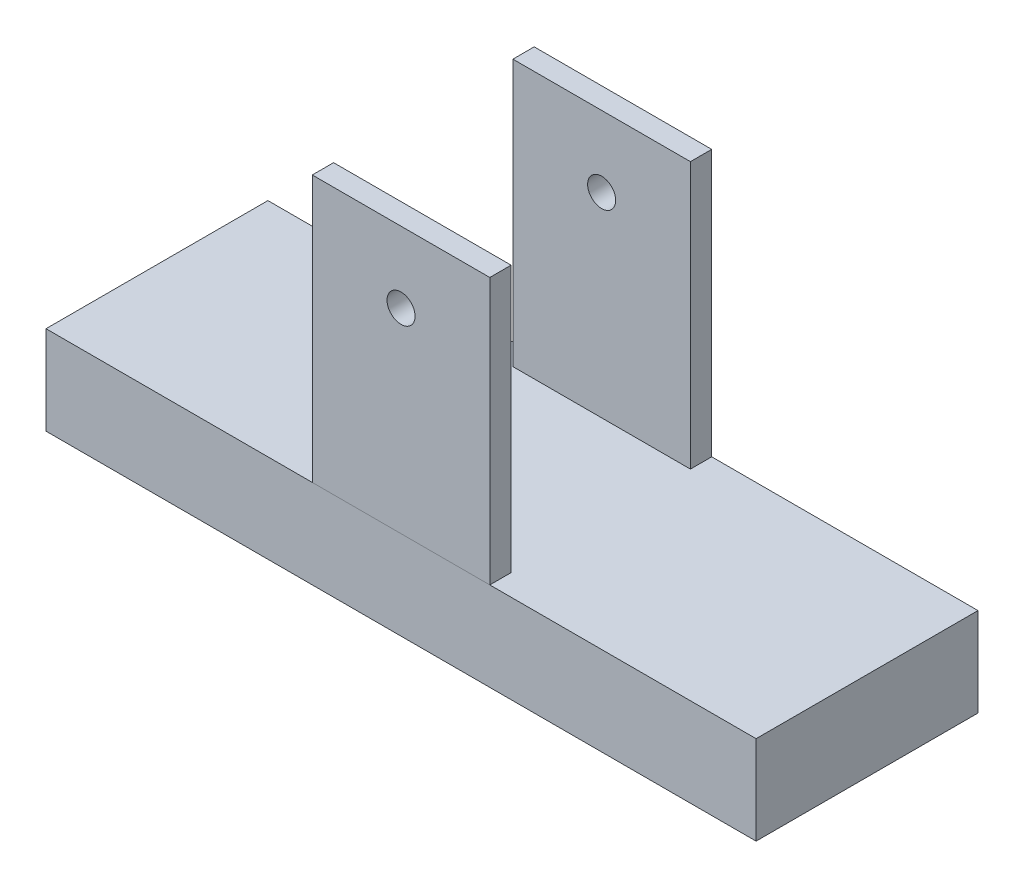
ISO-10303-21;
HEADER;
FILE_DESCRIPTION(('STEP AP214'),'2;1');
FILE_NAME('part.step','',(''),(''),'','','');
FILE_SCHEMA(('AUTOMOTIVE_DESIGN { 1 0 10303 214 1 1 1 1 }'));
ENDSEC;
DATA;
#1=APPLICATION_CONTEXT('core data for automotive mechanical design processes');
#2=APPLICATION_PROTOCOL_DEFINITION('international standard','automotive_design',2000,#1);
#3=PRODUCT_CONTEXT('',#1,'mechanical');
#4=PRODUCT('Part','Part','',(#3));
#5=PRODUCT_RELATED_PRODUCT_CATEGORY('part','',(#4));
#6=PRODUCT_DEFINITION_FORMATION('','',#4);
#7=PRODUCT_DEFINITION_CONTEXT('part definition',#1,'design');
#8=PRODUCT_DEFINITION('design','',#6,#7);
#9=PRODUCT_DEFINITION_SHAPE('','',#8);
#10=(LENGTH_UNIT() NAMED_UNIT(*) SI_UNIT(.MILLI.,.METRE.));
#11=(NAMED_UNIT(*) PLANE_ANGLE_UNIT() SI_UNIT($,.RADIAN.));
#12=(NAMED_UNIT(*) SI_UNIT($,.STERADIAN.) SOLID_ANGLE_UNIT());
#13=UNCERTAINTY_MEASURE_WITH_UNIT(LENGTH_MEASURE(1.E-05),#10,'distance_accuracy_value','');
#14=(GEOMETRIC_REPRESENTATION_CONTEXT(3) GLOBAL_UNCERTAINTY_ASSIGNED_CONTEXT((#13)) GLOBAL_UNIT_ASSIGNED_CONTEXT((#10,
#11,#12)) REPRESENTATION_CONTEXT('',''));
#15=CARTESIAN_POINT('',(0.,0.,0.));
#16=DIRECTION('',(0.,0.,1.));
#17=DIRECTION('',(1.,0.,0.));
#18=AXIS2_PLACEMENT_3D('',#15,#16,#17);
#19=CARTESIAN_POINT('',(-250.,200.,-113.));
#20=DIRECTION('',(0.,0.,-1.));
#21=DIRECTION('',(-1.,0.,0.));
#22=AXIS2_PLACEMENT_3D('',#19,#20,#21);
#23=PLANE('',#22);
#24=CARTESIAN_POINT('',(-200.,160.,-113.));
#25=DIRECTION('',(0.,0.,-1.));
#26=DIRECTION('',(-1.,0.,0.));
#27=AXIS2_PLACEMENT_3D('',#24,#25,#26);
#28=CIRCLE('',#27,7.89999999999999);
#29=CARTESIAN_POINT('',(-207.9,160.,-113.));
#30=VERTEX_POINT('',#29);
#31=EDGE_CURVE('E109',#30,#30,#28,.T.);
#32=ORIENTED_EDGE('',*,*,#31,.T.);
#33=EDGE_LOOP('',(#32));
#34=FACE_BOUND('',#33,.T.);
#35=DIRECTION('',(1.,0.,0.));
#36=VECTOR('',#35,1.);
#37=CARTESIAN_POINT('',(-250.,50.,-113.));
#38=LINE('',#37,#36);
#39=CARTESIAN_POINT('',(-250.,50.,-113.));
#40=VERTEX_POINT('',#39);
#41=CARTESIAN_POINT('',(-150.,50.,-113.));
#42=VERTEX_POINT('',#41);
#43=EDGE_CURVE('E106',#40,#42,#38,.T.);
#44=ORIENTED_EDGE('',*,*,#43,.T.);
#45=DIRECTION('',(0.,-1.,0.));
#46=VECTOR('',#45,1.);
#47=CARTESIAN_POINT('',(-150.,200.,-113.));
#48=LINE('',#47,#46);
#49=CARTESIAN_POINT('',(-150.,200.,-113.));
#50=VERTEX_POINT('',#49);
#51=EDGE_CURVE('E12',#50,#42,#48,.T.);
#52=ORIENTED_EDGE('',*,*,#51,.F.);
#53=DIRECTION('',(1.,0.,0.));
#54=VECTOR('',#53,1.);
#55=CARTESIAN_POINT('',(-250.,200.,-113.));
#56=LINE('',#55,#54);
#57=CARTESIAN_POINT('',(-250.,200.,-113.));
#58=VERTEX_POINT('',#57);
#59=EDGE_CURVE('E94',#58,#50,#56,.T.);
#60=ORIENTED_EDGE('',*,*,#59,.F.);
#61=DIRECTION('',(0.,-1.,0.));
#62=VECTOR('',#61,1.);
#63=CARTESIAN_POINT('',(-250.,200.,-113.));
#64=LINE('',#63,#62);
#65=EDGE_CURVE('E102',#58,#40,#64,.T.);
#66=ORIENTED_EDGE('',*,*,#65,.T.);
#67=EDGE_LOOP('',(#44,#52,#60,#66));
#68=FACE_BOUND('',#67,.T.);
#69=ADVANCED_FACE('F43',(#34,#68),#23,.F.);
#70=CARTESIAN_POINT('',(-150.,200.,-113.));
#71=DIRECTION('',(-1.,0.,0.));
#72=DIRECTION('',(0.,-1.,0.));
#73=AXIS2_PLACEMENT_3D('',#70,#71,#72);
#74=PLANE('',#73);
#75=DIRECTION('',(0.,0.,-1.));
#76=VECTOR('',#75,1.);
#77=CARTESIAN_POINT('',(-150.,50.,-113.));
#78=LINE('',#77,#76);
#79=CARTESIAN_POINT('',(-150.,50.,-125.));
#80=VERTEX_POINT('',#79);
#81=EDGE_CURVE('E98',#42,#80,#78,.T.);
#82=ORIENTED_EDGE('',*,*,#81,.T.);
#83=DIRECTION('',(0.,-1.,0.));
#84=VECTOR('',#83,1.);
#85=CARTESIAN_POINT('',(-150.,200.,-125.));
#86=LINE('',#85,#84);
#87=CARTESIAN_POINT('',(-150.,200.,-125.));
#88=VERTEX_POINT('',#87);
#89=EDGE_CURVE('E51',#88,#80,#86,.T.);
#90=ORIENTED_EDGE('',*,*,#89,.F.);
#91=DIRECTION('',(0.,0.,-1.));
#92=VECTOR('',#91,1.);
#93=CARTESIAN_POINT('',(-150.,200.,-113.));
#94=LINE('',#93,#92);
#95=EDGE_CURVE('E89',#50,#88,#94,.T.);
#96=ORIENTED_EDGE('',*,*,#95,.F.);
#97=ORIENTED_EDGE('',*,*,#51,.T.);
#98=EDGE_LOOP('',(#82,#90,#96,#97));
#99=FACE_BOUND('',#98,.T.);
#100=ADVANCED_FACE('F97',(#99),#74,.F.);
#101=CARTESIAN_POINT('',(-150.,200.,-125.));
#102=DIRECTION('',(0.,0.,1.));
#103=DIRECTION('',(1.,0.,0.));
#104=AXIS2_PLACEMENT_3D('',#101,#102,#103);
#105=PLANE('',#104);
#106=CARTESIAN_POINT('',(-200.,160.,-125.));
#107=DIRECTION('',(0.,0.,1.));
#108=DIRECTION('',(1.,0.,0.));
#109=AXIS2_PLACEMENT_3D('',#106,#107,#108);
#110=CIRCLE('',#109,7.89999999999999);
#111=CARTESIAN_POINT('',(-192.1,160.,-125.));
#112=VERTEX_POINT('',#111);
#113=EDGE_CURVE('E122',#112,#112,#110,.T.);
#114=ORIENTED_EDGE('',*,*,#113,.T.);
#115=EDGE_LOOP('',(#114));
#116=FACE_BOUND('',#115,.T.);
#117=DIRECTION('',(-1.,0.,0.));
#118=VECTOR('',#117,1.);
#119=CARTESIAN_POINT('',(-150.,50.,-125.));
#120=LINE('',#119,#118);
#121=CARTESIAN_POINT('',(-250.,50.,-125.));
#122=VERTEX_POINT('',#121);
#123=EDGE_CURVE('E76',#80,#122,#120,.T.);
#124=ORIENTED_EDGE('',*,*,#123,.T.);
#125=DIRECTION('',(0.,-1.,0.));
#126=VECTOR('',#125,1.);
#127=CARTESIAN_POINT('',(-250.,200.,-125.));
#128=LINE('',#127,#126);
#129=CARTESIAN_POINT('',(-250.,200.,-125.));
#130=VERTEX_POINT('',#129);
#131=EDGE_CURVE('E99',#130,#122,#128,.T.);
#132=ORIENTED_EDGE('',*,*,#131,.F.);
#133=DIRECTION('',(-1.,0.,0.));
#134=VECTOR('',#133,1.);
#135=CARTESIAN_POINT('',(-150.,200.,-125.));
#136=LINE('',#135,#134);
#137=EDGE_CURVE('E92',#88,#130,#136,.T.);
#138=ORIENTED_EDGE('',*,*,#137,.F.);
#139=ORIENTED_EDGE('',*,*,#89,.T.);
#140=EDGE_LOOP('',(#124,#132,#138,#139));
#141=FACE_BOUND('',#140,.T.);
#142=ADVANCED_FACE('F100',(#116,#141),#105,.F.);
#143=CARTESIAN_POINT('',(-250.,200.,-125.));
#144=DIRECTION('',(1.,0.,0.));
#145=DIRECTION('',(0.,1.,0.));
#146=AXIS2_PLACEMENT_3D('',#143,#144,#145);
#147=PLANE('',#146);
#148=DIRECTION('',(0.,0.,1.));
#149=VECTOR('',#148,1.);
#150=CARTESIAN_POINT('',(-250.,50.,-125.));
#151=LINE('',#150,#149);
#152=EDGE_CURVE('E82',#122,#40,#151,.T.);
#153=ORIENTED_EDGE('',*,*,#152,.T.);
#154=ORIENTED_EDGE('',*,*,#65,.F.);
#155=DIRECTION('',(0.,0.,1.));
#156=VECTOR('',#155,1.);
#157=CARTESIAN_POINT('',(-250.,200.,-125.));
#158=LINE('',#157,#156);
#159=EDGE_CURVE('E59',#130,#58,#158,.T.);
#160=ORIENTED_EDGE('',*,*,#159,.F.);
#161=ORIENTED_EDGE('',*,*,#131,.T.);
#162=EDGE_LOOP('',(#153,#154,#160,#161));
#163=FACE_BOUND('',#162,.T.);
#164=ADVANCED_FACE('F114',(#163),#147,.F.);
#165=CARTESIAN_POINT('',(0.,200.,0.));
#166=DIRECTION('',(0.,1.,0.));
#167=DIRECTION('',(-1.,0.,0.));
#168=AXIS2_PLACEMENT_3D('',#165,#166,#167);
#169=PLANE('',#168);
#170=ORIENTED_EDGE('',*,*,#59,.T.);
#171=ORIENTED_EDGE('',*,*,#95,.T.);
#172=ORIENTED_EDGE('',*,*,#137,.T.);
#173=ORIENTED_EDGE('',*,*,#159,.T.);
#174=EDGE_LOOP('',(#170,#171,#172,#173));
#175=FACE_BOUND('',#174,.T.);
#176=ADVANCED_FACE('F90',(#175),#169,.T.);
#177=CARTESIAN_POINT('',(0.,50.,0.));
#178=DIRECTION('',(0.,1.,0.));
#179=DIRECTION('',(-1.,0.,0.));
#180=AXIS2_PLACEMENT_3D('',#177,#178,#179);
#181=PLANE('',#180);
#182=ORIENTED_EDGE('',*,*,#43,.F.);
#183=ORIENTED_EDGE('',*,*,#152,.F.);
#184=ORIENTED_EDGE('',*,*,#123,.F.);
#185=ORIENTED_EDGE('',*,*,#81,.F.);
#186=EDGE_LOOP('',(#182,#183,#184,#185));
#187=FACE_BOUND('',#186,.T.);
#188=ADVANCED_FACE('F117',(#187),#181,.F.);
#189=CARTESIAN_POINT('',(-200.,160.,-125.));
#190=DIRECTION('',(0.,0.,1.));
#191=DIRECTION('',(1.,0.,0.));
#192=AXIS2_PLACEMENT_3D('',#189,#190,#191);
#193=CYLINDRICAL_SURFACE('',#192,7.89999999999999);
#194=ORIENTED_EDGE('',*,*,#113,.F.);
#195=EDGE_LOOP('',(#194));
#196=FACE_BOUND('',#195,.T.);
#197=ORIENTED_EDGE('',*,*,#31,.F.);
#198=EDGE_LOOP('',(#197));
#199=FACE_BOUND('',#198,.T.);
#200=ADVANCED_FACE('F127',(#196,#199),#193,.F.);
#201=CLOSED_SHELL('',(#69,#100,#142,#164,#176,#188,#200));
#202=MANIFOLD_SOLID_BREP('B2',#201);
#203=CARTESIAN_POINT('',(-150.,200.,0.));
#204=DIRECTION('',(0.,0.,-1.));
#205=DIRECTION('',(-1.,0.,0.));
#206=AXIS2_PLACEMENT_3D('',#203,#204,#205);
#207=PLANE('',#206);
#208=CARTESIAN_POINT('',(-200.,160.,0.));
#209=DIRECTION('',(0.,0.,-1.));
#210=DIRECTION('',(-1.,0.,0.));
#211=AXIS2_PLACEMENT_3D('',#208,#209,#210);
#212=CIRCLE('',#211,7.89999999999999);
#213=CARTESIAN_POINT('',(-207.9,160.,0.));
#214=VERTEX_POINT('',#213);
#215=EDGE_CURVE('E264',#214,#214,#212,.T.);
#216=ORIENTED_EDGE('',*,*,#215,.T.);
#217=EDGE_LOOP('',(#216));
#218=FACE_BOUND('',#217,.T.);
#219=DIRECTION('',(1.,0.,0.));
#220=VECTOR('',#219,1.);
#221=CARTESIAN_POINT('',(-150.,50.,0.));
#222=LINE('',#221,#220);
#223=CARTESIAN_POINT('',(-250.,50.,0.));
#224=VERTEX_POINT('',#223);
#225=CARTESIAN_POINT('',(-150.,50.,0.));
#226=VERTEX_POINT('',#225);
#227=EDGE_CURVE('E261',#224,#226,#222,.T.);
#228=ORIENTED_EDGE('',*,*,#227,.T.);
#229=DIRECTION('',(0.,-1.,0.));
#230=VECTOR('',#229,1.);
#231=CARTESIAN_POINT('',(-150.,200.,0.));
#232=LINE('',#231,#230);
#233=CARTESIAN_POINT('',(-150.,200.,0.));
#234=VERTEX_POINT('',#233);
#235=EDGE_CURVE('E41',#234,#226,#232,.T.);
#236=ORIENTED_EDGE('',*,*,#235,.F.);
#237=DIRECTION('',(1.,0.,0.));
#238=VECTOR('',#237,1.);
#239=CARTESIAN_POINT('',(-150.,200.,0.));
#240=LINE('',#239,#238);
#241=CARTESIAN_POINT('',(-250.,200.,0.));
#242=VERTEX_POINT('',#241);
#243=EDGE_CURVE('E248',#242,#234,#240,.T.);
#244=ORIENTED_EDGE('',*,*,#243,.F.);
#245=DIRECTION('',(0.,-1.,0.));
#246=VECTOR('',#245,1.);
#247=CARTESIAN_POINT('',(-250.,200.,0.));
#248=LINE('',#247,#246);
#249=EDGE_CURVE('E257',#242,#224,#248,.T.);
#250=ORIENTED_EDGE('',*,*,#249,.T.);
#251=EDGE_LOOP('',(#228,#236,#244,#250));
#252=FACE_BOUND('',#251,.T.);
#253=ADVANCED_FACE('F196',(#218,#252),#207,.F.);
#254=CARTESIAN_POINT('',(-150.,200.,-12.));
#255=DIRECTION('',(-1.,0.,0.));
#256=DIRECTION('',(0.,-1.,0.));
#257=AXIS2_PLACEMENT_3D('',#254,#255,#256);
#258=PLANE('',#257);
#259=DIRECTION('',(0.,0.,-1.));
#260=VECTOR('',#259,1.);
#261=CARTESIAN_POINT('',(-150.,50.,-12.));
#262=LINE('',#261,#260);
#263=CARTESIAN_POINT('',(-150.,50.,-12.));
#264=VERTEX_POINT('',#263);
#265=EDGE_CURVE('E252',#226,#264,#262,.T.);
#266=ORIENTED_EDGE('',*,*,#265,.T.);
#267=DIRECTION('',(0.,-1.,0.));
#268=VECTOR('',#267,1.);
#269=CARTESIAN_POINT('',(-150.,200.,-12.));
#270=LINE('',#269,#268);
#271=CARTESIAN_POINT('',(-150.,200.,-12.));
#272=VERTEX_POINT('',#271);
#273=EDGE_CURVE('E205',#272,#264,#270,.T.);
#274=ORIENTED_EDGE('',*,*,#273,.F.);
#275=DIRECTION('',(0.,0.,-1.));
#276=VECTOR('',#275,1.);
#277=CARTESIAN_POINT('',(-150.,200.,-12.));
#278=LINE('',#277,#276);
#279=EDGE_CURVE('E243',#234,#272,#278,.T.);
#280=ORIENTED_EDGE('',*,*,#279,.F.);
#281=ORIENTED_EDGE('',*,*,#235,.T.);
#282=EDGE_LOOP('',(#266,#274,#280,#281));
#283=FACE_BOUND('',#282,.T.);
#284=ADVANCED_FACE('F251',(#283),#258,.F.);
#285=CARTESIAN_POINT('',(-250.,200.,-12.));
#286=DIRECTION('',(0.,0.,1.));
#287=DIRECTION('',(1.,0.,0.));
#288=AXIS2_PLACEMENT_3D('',#285,#286,#287);
#289=PLANE('',#288);
#290=CARTESIAN_POINT('',(-200.,160.,-12.));
#291=DIRECTION('',(0.,0.,1.));
#292=DIRECTION('',(1.,0.,0.));
#293=AXIS2_PLACEMENT_3D('',#290,#291,#292);
#294=CIRCLE('',#293,7.89999999999999);
#295=CARTESIAN_POINT('',(-192.1,160.,-12.));
#296=VERTEX_POINT('',#295);
#297=EDGE_CURVE('E199',#296,#296,#294,.T.);
#298=ORIENTED_EDGE('',*,*,#297,.T.);
#299=EDGE_LOOP('',(#298));
#300=FACE_BOUND('',#299,.T.);
#301=DIRECTION('',(-1.,0.,0.));
#302=VECTOR('',#301,1.);
#303=CARTESIAN_POINT('',(-250.,50.,-12.));
#304=LINE('',#303,#302);
#305=CARTESIAN_POINT('',(-250.,50.,-12.));
#306=VERTEX_POINT('',#305);
#307=EDGE_CURVE('E230',#264,#306,#304,.T.);
#308=ORIENTED_EDGE('',*,*,#307,.T.);
#309=DIRECTION('',(0.,-1.,0.));
#310=VECTOR('',#309,1.);
#311=CARTESIAN_POINT('',(-250.,200.,-12.));
#312=LINE('',#311,#310);
#313=CARTESIAN_POINT('',(-250.,200.,-12.));
#314=VERTEX_POINT('',#313);
#315=EDGE_CURVE('E253',#314,#306,#312,.T.);
#316=ORIENTED_EDGE('',*,*,#315,.F.);
#317=DIRECTION('',(-1.,0.,0.));
#318=VECTOR('',#317,1.);
#319=CARTESIAN_POINT('',(-250.,200.,-12.));
#320=LINE('',#319,#318);
#321=EDGE_CURVE('E246',#272,#314,#320,.T.);
#322=ORIENTED_EDGE('',*,*,#321,.F.);
#323=ORIENTED_EDGE('',*,*,#273,.T.);
#324=EDGE_LOOP('',(#308,#316,#322,#323));
#325=FACE_BOUND('',#324,.T.);
#326=ADVANCED_FACE('F255',(#300,#325),#289,.F.);
#327=CARTESIAN_POINT('',(-250.,200.,0.));
#328=DIRECTION('',(1.,0.,0.));
#329=DIRECTION('',(0.,1.,0.));
#330=AXIS2_PLACEMENT_3D('',#327,#328,#329);
#331=PLANE('',#330);
#332=DIRECTION('',(0.,0.,1.));
#333=VECTOR('',#332,1.);
#334=CARTESIAN_POINT('',(-250.,50.,0.));
#335=LINE('',#334,#333);
#336=EDGE_CURVE('E236',#306,#224,#335,.T.);
#337=ORIENTED_EDGE('',*,*,#336,.T.);
#338=ORIENTED_EDGE('',*,*,#249,.F.);
#339=DIRECTION('',(0.,0.,1.));
#340=VECTOR('',#339,1.);
#341=CARTESIAN_POINT('',(-250.,200.,0.));
#342=LINE('',#341,#340);
#343=EDGE_CURVE('E213',#314,#242,#342,.T.);
#344=ORIENTED_EDGE('',*,*,#343,.F.);
#345=ORIENTED_EDGE('',*,*,#315,.T.);
#346=EDGE_LOOP('',(#337,#338,#344,#345));
#347=FACE_BOUND('',#346,.T.);
#348=ADVANCED_FACE('F269',(#347),#331,.F.);
#349=CARTESIAN_POINT('',(0.,200.,0.));
#350=DIRECTION('',(0.,-1.,0.));
#351=DIRECTION('',(1.,0.,0.));
#352=AXIS2_PLACEMENT_3D('',#349,#350,#351);
#353=PLANE('',#352);
#354=ORIENTED_EDGE('',*,*,#243,.T.);
#355=ORIENTED_EDGE('',*,*,#279,.T.);
#356=ORIENTED_EDGE('',*,*,#321,.T.);
#357=ORIENTED_EDGE('',*,*,#343,.T.);
#358=EDGE_LOOP('',(#354,#355,#356,#357));
#359=FACE_BOUND('',#358,.T.);
#360=ADVANCED_FACE('F244',(#359),#353,.F.);
#361=CARTESIAN_POINT('',(0.,50.,0.));
#362=DIRECTION('',(0.,-1.,0.));
#363=DIRECTION('',(1.,0.,0.));
#364=AXIS2_PLACEMENT_3D('',#361,#362,#363);
#365=PLANE('',#364);
#366=ORIENTED_EDGE('',*,*,#227,.F.);
#367=ORIENTED_EDGE('',*,*,#336,.F.);
#368=ORIENTED_EDGE('',*,*,#307,.F.);
#369=ORIENTED_EDGE('',*,*,#265,.F.);
#370=EDGE_LOOP('',(#366,#367,#368,#369));
#371=FACE_BOUND('',#370,.T.);
#372=ADVANCED_FACE('F272',(#371),#365,.T.);
#373=CARTESIAN_POINT('',(-200.,160.,-125.));
#374=DIRECTION('',(0.,0.,1.));
#375=DIRECTION('',(1.,0.,0.));
#376=AXIS2_PLACEMENT_3D('',#373,#374,#375);
#377=CYLINDRICAL_SURFACE('',#376,7.89999999999999);
#378=ORIENTED_EDGE('',*,*,#297,.F.);
#379=EDGE_LOOP('',(#378));
#380=FACE_BOUND('',#379,.T.);
#381=ORIENTED_EDGE('',*,*,#215,.F.);
#382=EDGE_LOOP('',(#381));
#383=FACE_BOUND('',#382,.T.);
#384=ADVANCED_FACE('F282',(#380,#383),#377,.F.);
#385=CLOSED_SHELL('',(#253,#284,#326,#348,#360,#372,#384));
#386=MANIFOLD_SOLID_BREP('B6',#385);
#387=CARTESIAN_POINT('',(0.,0.,-125.));
#388=DIRECTION('',(1.,0.,0.));
#389=DIRECTION('',(0.,0.,-1.));
#390=AXIS2_PLACEMENT_3D('',#387,#388,#389);
#391=PLANE('',#390);
#392=DIRECTION('',(0.,1.,0.));
#393=VECTOR('',#392,1.);
#394=CARTESIAN_POINT('',(0.,0.,0.));
#395=LINE('',#394,#393);
#396=CARTESIAN_POINT('',(0.,0.,0.));
#397=VERTEX_POINT('',#396);
#398=CARTESIAN_POINT('',(0.,50.,0.));
#399=VERTEX_POINT('',#398);
#400=EDGE_CURVE('E404',#397,#399,#395,.T.);
#401=ORIENTED_EDGE('',*,*,#400,.F.);
#402=DIRECTION('',(0.,0.,1.));
#403=VECTOR('',#402,1.);
#404=CARTESIAN_POINT('',(0.,0.,-125.));
#405=LINE('',#404,#403);
#406=CARTESIAN_POINT('',(0.,0.,-125.));
#407=VERTEX_POINT('',#406);
#408=EDGE_CURVE('E194',#407,#397,#405,.T.);
#409=ORIENTED_EDGE('',*,*,#408,.F.);
#410=DIRECTION('',(0.,1.,0.));
#411=VECTOR('',#410,1.);
#412=CARTESIAN_POINT('',(0.,0.,-125.));
#413=LINE('',#412,#411);
#414=CARTESIAN_POINT('',(0.,50.,-125.));
#415=VERTEX_POINT('',#414);
#416=EDGE_CURVE('E398',#407,#415,#413,.T.);
#417=ORIENTED_EDGE('',*,*,#416,.T.);
#418=DIRECTION('',(0.,0.,1.));
#419=VECTOR('',#418,1.);
#420=CARTESIAN_POINT('',(0.,50.,-125.));
#421=LINE('',#420,#419);
#422=EDGE_CURVE('E343',#415,#399,#421,.T.);
#423=ORIENTED_EDGE('',*,*,#422,.T.);
#424=EDGE_LOOP('',(#401,#409,#417,#423));
#425=FACE_BOUND('',#424,.T.);
#426=ADVANCED_FACE('F340',(#425),#391,.T.);
#427=CARTESIAN_POINT('',(0.,0.,-125.));
#428=DIRECTION('',(0.,-1.,0.));
#429=DIRECTION('',(1.,0.,0.));
#430=AXIS2_PLACEMENT_3D('',#427,#428,#429);
#431=PLANE('',#430);
#432=DIRECTION('',(1.,0.,0.));
#433=VECTOR('',#432,1.);
#434=CARTESIAN_POINT('',(0.,0.,0.));
#435=LINE('',#434,#433);
#436=CARTESIAN_POINT('',(-400.,0.,0.));
#437=VERTEX_POINT('',#436);
#438=EDGE_CURVE('E400',#437,#397,#435,.T.);
#439=ORIENTED_EDGE('',*,*,#438,.F.);
#440=DIRECTION('',(0.,0.,1.));
#441=VECTOR('',#440,1.);
#442=CARTESIAN_POINT('',(-400.,0.,-125.));
#443=LINE('',#442,#441);
#444=CARTESIAN_POINT('',(-400.,0.,-125.));
#445=VERTEX_POINT('',#444);
#446=EDGE_CURVE('E349',#445,#437,#443,.T.);
#447=ORIENTED_EDGE('',*,*,#446,.F.);
#448=DIRECTION('',(1.,0.,0.));
#449=VECTOR('',#448,1.);
#450=CARTESIAN_POINT('',(0.,0.,-125.));
#451=LINE('',#450,#449);
#452=EDGE_CURVE('E395',#445,#407,#451,.T.);
#453=ORIENTED_EDGE('',*,*,#452,.T.);
#454=ORIENTED_EDGE('',*,*,#408,.T.);
#455=EDGE_LOOP('',(#439,#447,#453,#454));
#456=FACE_BOUND('',#455,.T.);
#457=ADVANCED_FACE('F414',(#456),#431,.T.);
#458=CARTESIAN_POINT('',(-400.,0.,-125.));
#459=DIRECTION('',(-1.,0.,0.));
#460=DIRECTION('',(0.,0.,1.));
#461=AXIS2_PLACEMENT_3D('',#458,#459,#460);
#462=PLANE('',#461);
#463=DIRECTION('',(0.,-1.,0.));
#464=VECTOR('',#463,1.);
#465=CARTESIAN_POINT('',(-400.,0.,0.));
#466=LINE('',#465,#464);
#467=CARTESIAN_POINT('',(-400.,50.,0.));
#468=VERTEX_POINT('',#467);
#469=EDGE_CURVE('E390',#468,#437,#466,.T.);
#470=ORIENTED_EDGE('',*,*,#469,.F.);
#471=DIRECTION('',(0.,0.,1.));
#472=VECTOR('',#471,1.);
#473=CARTESIAN_POINT('',(-400.,50.,-125.));
#474=LINE('',#473,#472);
#475=CARTESIAN_POINT('',(-400.,50.,-125.));
#476=VERTEX_POINT('',#475);
#477=EDGE_CURVE('E385',#476,#468,#474,.T.);
#478=ORIENTED_EDGE('',*,*,#477,.F.);
#479=DIRECTION('',(0.,-1.,0.));
#480=VECTOR('',#479,1.);
#481=CARTESIAN_POINT('',(-400.,0.,-125.));
#482=LINE('',#481,#480);
#483=EDGE_CURVE('E388',#476,#445,#482,.T.);
#484=ORIENTED_EDGE('',*,*,#483,.T.);
#485=ORIENTED_EDGE('',*,*,#446,.T.);
#486=EDGE_LOOP('',(#470,#478,#484,#485));
#487=FACE_BOUND('',#486,.T.);
#488=ADVANCED_FACE('F387',(#487),#462,.T.);
#489=CARTESIAN_POINT('',(0.,50.,-125.));
#490=DIRECTION('',(0.,1.,0.));
#491=DIRECTION('',(-1.,0.,0.));
#492=AXIS2_PLACEMENT_3D('',#489,#490,#491);
#493=PLANE('',#492);
#494=DIRECTION('',(-1.,0.,0.));
#495=VECTOR('',#494,1.);
#496=CARTESIAN_POINT('',(0.,50.,0.));
#497=LINE('',#496,#495);
#498=EDGE_CURVE('E407',#399,#468,#497,.T.);
#499=ORIENTED_EDGE('',*,*,#498,.F.);
#500=ORIENTED_EDGE('',*,*,#422,.F.);
#501=DIRECTION('',(-1.,0.,0.));
#502=VECTOR('',#501,1.);
#503=CARTESIAN_POINT('',(0.,50.,-125.));
#504=LINE('',#503,#502);
#505=EDGE_CURVE('E394',#415,#476,#504,.T.);
#506=ORIENTED_EDGE('',*,*,#505,.T.);
#507=ORIENTED_EDGE('',*,*,#477,.T.);
#508=EDGE_LOOP('',(#499,#500,#506,#507));
#509=FACE_BOUND('',#508,.T.);
#510=ADVANCED_FACE('F397',(#509),#493,.T.);
#511=CARTESIAN_POINT('',(0.,0.,-125.));
#512=DIRECTION('',(0.,0.,1.));
#513=DIRECTION('',(1.,0.,0.));
#514=AXIS2_PLACEMENT_3D('',#511,#512,#513);
#515=PLANE('',#514);
#516=ORIENTED_EDGE('',*,*,#416,.F.);
#517=ORIENTED_EDGE('',*,*,#452,.F.);
#518=ORIENTED_EDGE('',*,*,#483,.F.);
#519=ORIENTED_EDGE('',*,*,#505,.F.);
#520=EDGE_LOOP('',(#516,#517,#518,#519));
#521=FACE_BOUND('',#520,.T.);
#522=ADVANCED_FACE('F393',(#521),#515,.F.);
#523=CARTESIAN_POINT('',(0.,0.,0.));
#524=DIRECTION('',(0.,0.,1.));
#525=DIRECTION('',(1.,0.,0.));
#526=AXIS2_PLACEMENT_3D('',#523,#524,#525);
#527=PLANE('',#526);
#528=ORIENTED_EDGE('',*,*,#400,.T.);
#529=ORIENTED_EDGE('',*,*,#498,.T.);
#530=ORIENTED_EDGE('',*,*,#469,.T.);
#531=ORIENTED_EDGE('',*,*,#438,.T.);
#532=EDGE_LOOP('',(#528,#529,#530,#531));
#533=FACE_BOUND('',#532,.T.);
#534=ADVANCED_FACE('F413',(#533),#527,.T.);
#535=CLOSED_SHELL('',(#426,#457,#488,#510,#522,#534));
#536=MANIFOLD_SOLID_BREP('B35',#535);
#537=ADVANCED_BREP_SHAPE_REPRESENTATION('',(#18,#202,#386,#536),#14);
#538=SHAPE_DEFINITION_REPRESENTATION(#9,#537);
ENDSEC;
END-ISO-10303-21;
